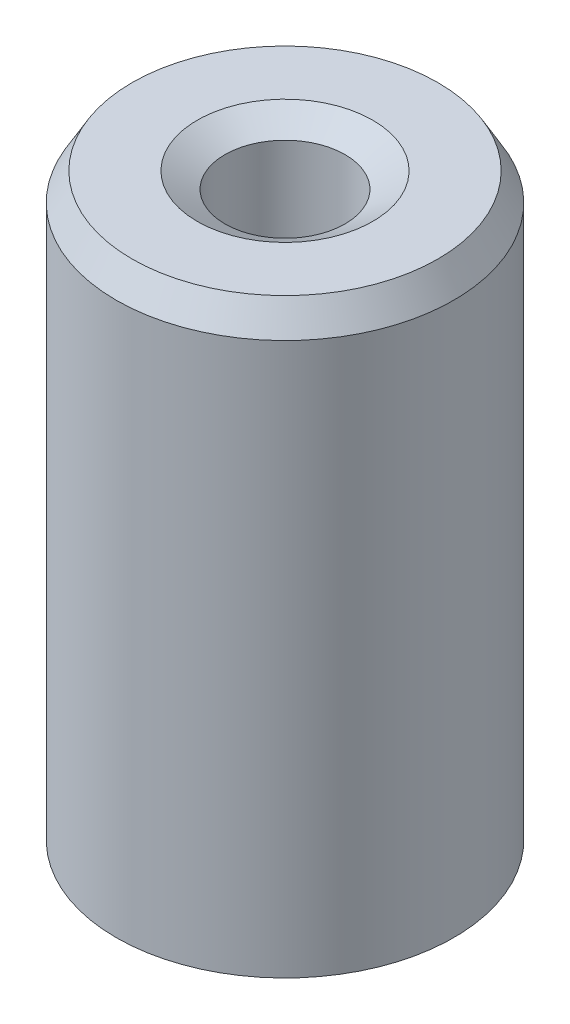
ISO-10303-21;
HEADER;
FILE_DESCRIPTION(('STEP AP214'),'2;1');
FILE_NAME('part.step','',(''),(''),'','','');
FILE_SCHEMA(('AUTOMOTIVE_DESIGN { 1 0 10303 214 1 1 1 1 }'));
ENDSEC;
DATA;
#1=APPLICATION_CONTEXT('core data for automotive mechanical design processes');
#2=APPLICATION_PROTOCOL_DEFINITION('international standard','automotive_design',2000,#1);
#3=PRODUCT_CONTEXT('',#1,'mechanical');
#4=PRODUCT('Part','Part','',(#3));
#5=PRODUCT_RELATED_PRODUCT_CATEGORY('part','',(#4));
#6=PRODUCT_DEFINITION_FORMATION('','',#4);
#7=PRODUCT_DEFINITION_CONTEXT('part definition',#1,'design');
#8=PRODUCT_DEFINITION('design','',#6,#7);
#9=PRODUCT_DEFINITION_SHAPE('','',#8);
#10=(LENGTH_UNIT() NAMED_UNIT(*) SI_UNIT(.MILLI.,.METRE.));
#11=(NAMED_UNIT(*) PLANE_ANGLE_UNIT() SI_UNIT($,.RADIAN.));
#12=(NAMED_UNIT(*) SI_UNIT($,.STERADIAN.) SOLID_ANGLE_UNIT());
#13=UNCERTAINTY_MEASURE_WITH_UNIT(LENGTH_MEASURE(1.E-05),#10,'distance_accuracy_value','');
#14=(GEOMETRIC_REPRESENTATION_CONTEXT(3) GLOBAL_UNCERTAINTY_ASSIGNED_CONTEXT((#13)) GLOBAL_UNIT_ASSIGNED_CONTEXT((#10,
#11,#12)) REPRESENTATION_CONTEXT('',''));
#15=CARTESIAN_POINT('',(0.,0.,0.));
#16=DIRECTION('',(0.,0.,1.));
#17=DIRECTION('',(1.,0.,0.));
#18=AXIS2_PLACEMENT_3D('',#15,#16,#17);
#19=CARTESIAN_POINT('',(0.,26.462460694891,0.));
#20=DIRECTION('',(0.,-1.,0.));
#21=DIRECTION('',(0.,0.,-1.));
#22=AXIS2_PLACEMENT_3D('',#19,#20,#21);
#23=CYLINDRICAL_SURFACE('',#22,7.5);
#24=CARTESIAN_POINT('',(0.,0.70944082375634,0.));
#25=DIRECTION('',(0.,1.,0.));
#26=DIRECTION('',(0.,0.,1.));
#27=AXIS2_PLACEMENT_3D('',#24,#25,#26);
#28=CIRCLE('',#27,7.5);
#29=CARTESIAN_POINT('',(0.,0.709440823756336,-7.5));
#30=VERTEX_POINT('',#29);
#31=EDGE_CURVE('E10',#30,#30,#28,.T.);
#32=CARTESIAN_POINT('',(0.,25.2336731431815,0.));
#33=DIRECTION('',(0.,1.,0.));
#34=DIRECTION('',(0.,0.,1.));
#35=AXIS2_PLACEMENT_3D('',#32,#33,#34);
#36=CIRCLE('',#35,7.5);
#37=CARTESIAN_POINT('',(0.,25.2336731431815,-7.5));
#38=VERTEX_POINT('',#37);
#39=EDGE_CURVE('E50',#38,#38,#36,.F.);
#40=CARTESIAN_POINT('',(0.,0.709440823756336,-7.5));
#41=CARTESIAN_POINT('',(0.,0.964901577083682,-7.5));
#42=CARTESIAN_POINT('',(0.,1.22036233041103,-7.5));
#43=CARTESIAN_POINT('',(0.,1.73128383706572,-7.5));
#44=CARTESIAN_POINT('',(0.,1.98674459039307,-7.5));
#45=CARTESIAN_POINT('',(0.,2.49766609704776,-7.5));
#46=CARTESIAN_POINT('',(0.,2.7531268503751,-7.5));
#47=CARTESIAN_POINT('',(0.,3.26404835702979,-7.5));
#48=CARTESIAN_POINT('',(0.,3.51950911035714,-7.5));
#49=CARTESIAN_POINT('',(0.,4.03043061701183,-7.5));
#50=CARTESIAN_POINT('',(0.,4.28589137033918,-7.5));
#51=CARTESIAN_POINT('',(0.,4.79681287699387,-7.5));
#52=CARTESIAN_POINT('',(0.,5.05227363032122,-7.5));
#53=CARTESIAN_POINT('',(0.,5.56319513697591,-7.5));
#54=CARTESIAN_POINT('',(0.,5.81865589030325,-7.5));
#55=CARTESIAN_POINT('',(0.,6.32957739695794,-7.5));
#56=CARTESIAN_POINT('',(0.,6.58503815028529,-7.5));
#57=CARTESIAN_POINT('',(0.,7.09595965693998,-7.5));
#58=CARTESIAN_POINT('',(0.,7.35142041026733,-7.5));
#59=CARTESIAN_POINT('',(0.,7.86234191692202,-7.5));
#60=CARTESIAN_POINT('',(0.,8.11780267024936,-7.5));
#61=CARTESIAN_POINT('',(0.,8.62872417690406,-7.5));
#62=CARTESIAN_POINT('',(0.,8.8841849302314,-7.5));
#63=CARTESIAN_POINT('',(0.,9.39510643688609,-7.5));
#64=CARTESIAN_POINT('',(0.,9.65056719021344,-7.5));
#65=CARTESIAN_POINT('',(0.,10.1614886968681,-7.5));
#66=CARTESIAN_POINT('',(0.,10.4169494501955,-7.5));
#67=CARTESIAN_POINT('',(0.,10.9278709568502,-7.5));
#68=CARTESIAN_POINT('',(0.,11.1833317101775,-7.5));
#69=CARTESIAN_POINT('',(0.,11.6942532168322,-7.5));
#70=CARTESIAN_POINT('',(0.,11.9497139701595,-7.5));
#71=CARTESIAN_POINT('',(0.,12.4606354768142,-7.5));
#72=CARTESIAN_POINT('',(0.,12.7160962301416,-7.5));
#73=CARTESIAN_POINT('',(0.,13.2270177367963,-7.5));
#74=CARTESIAN_POINT('',(0.,13.4824784901236,-7.5));
#75=CARTESIAN_POINT('',(0.,13.9933999967783,-7.5));
#76=CARTESIAN_POINT('',(0.,14.2488607501057,-7.5));
#77=CARTESIAN_POINT('',(0.,14.7597822567604,-7.5));
#78=CARTESIAN_POINT('',(0.,15.0152430100877,-7.5));
#79=CARTESIAN_POINT('',(0.,15.5261645167424,-7.5));
#80=CARTESIAN_POINT('',(0.,15.7816252700697,-7.5));
#81=CARTESIAN_POINT('',(0.,16.2925467767244,-7.5));
#82=CARTESIAN_POINT('',(0.,16.5480075300518,-7.5));
#83=CARTESIAN_POINT('',(0.,17.0589290367065,-7.5));
#84=CARTESIAN_POINT('',(0.,17.3143897900338,-7.5));
#85=CARTESIAN_POINT('',(0.,17.8253112966885,-7.5));
#86=CARTESIAN_POINT('',(0.,18.0807720500158,-7.5));
#87=CARTESIAN_POINT('',(0.,18.5916935566705,-7.5));
#88=CARTESIAN_POINT('',(0.,18.8471543099979,-7.5));
#89=CARTESIAN_POINT('',(0.,19.3580758166526,-7.5));
#90=CARTESIAN_POINT('',(0.,19.6135365699799,-7.5));
#91=CARTESIAN_POINT('',(0.,20.1244580766346,-7.5));
#92=CARTESIAN_POINT('',(0.,20.379918829962,-7.5));
#93=CARTESIAN_POINT('',(0.,20.8908403366166,-7.5));
#94=CARTESIAN_POINT('',(0.,21.146301089944,-7.5));
#95=CARTESIAN_POINT('',(0.,21.6572225965987,-7.5));
#96=CARTESIAN_POINT('',(0.,21.912683349926,-7.5));
#97=CARTESIAN_POINT('',(0.,22.4236048565807,-7.5));
#98=CARTESIAN_POINT('',(0.,22.6790656099081,-7.5));
#99=CARTESIAN_POINT('',(0.,23.1899871165628,-7.5));
#100=CARTESIAN_POINT('',(0.,23.4454478698901,-7.5));
#101=CARTESIAN_POINT('',(0.,23.9563693765448,-7.5));
#102=CARTESIAN_POINT('',(0.,24.2118301298721,-7.5));
#103=CARTESIAN_POINT('',(0.,24.7227516365268,-7.5));
#104=CARTESIAN_POINT('',(0.,24.9782123898542,-7.5));
#105=CARTESIAN_POINT('',(0.,25.2336731431815,-7.5));
#106=B_SPLINE_CURVE_WITH_KNOTS('',3,(#40,#41,#42,#43,#44,#45,#46,#47,#48,#49,#50,#51,#52,#53,
#54,#55,#56,#57,#58,#59,#60,#61,#62,#63,#64,#65,#66,#67,#68,#69,#70,#71,#72,#73,#74,#75,#76,#77,
#78,#79,#80,#81,#82,#83,#84,#85,#86,#87,#88,#89,#90,#91,#92,#93,#94,#95,#96,#97,#98,#99,#100,
#101,#102,#103,#104,#105),.UNSPECIFIED.,.F.,.F.,(4,2,2,2,2,2,2,2,2,2,2,2,2,2,2,2,2,2,2,2,2,2,2,
2,2,2,2,2,2,2,2,2,4),(0.,0.766382259982039,1.53276451996407,2.29914677994611,3.06552903992815,
3.83191129991019,4.59829355989223,5.36467581987426,6.1310580798563,6.89744033983834,
7.66382259982037,8.43020485980241,9.19658711978445,9.96296937976648,10.7293516397485,
11.4957338997306,12.2621161597126,13.0284984196946,13.7948806796767,14.5612629396587,
15.3276451996407,16.0940274596228,16.8604097196048,17.6267919795869,18.3931742395689,
19.1595564995509,19.925938759533,20.692321019515,21.458703279497,22.2250855394791,
22.9914677994611,23.7578500594432,24.5242323194252),.UNSPECIFIED.);
#107=EDGE_CURVE('BSEAM39',#30,#38,#106,.T.);
#108=ORIENTED_EDGE('',*,*,#31,.T.);
#109=ORIENTED_EDGE('',*,*,#39,.T.);
#110=ORIENTED_EDGE('',*,*,#107,.T.);
#111=ORIENTED_EDGE('',*,*,#107,.F.);
#112=EDGE_LOOP('',(#108,#110,#109,#111));
#113=FACE_BOUND('',#112,.T.);
#114=ADVANCED_FACE('F39',(#113),#23,.T.);
#115=CARTESIAN_POINT('',(0.,26.462460694891,0.));
#116=DIRECTION('',(0.,1.,0.));
#117=DIRECTION('',(0.,0.,1.));
#118=AXIS2_PLACEMENT_3D('',#115,#116,#117);
#119=PLANE('',#118);
#120=CARTESIAN_POINT('',(0.,26.462460694891,0.));
#121=DIRECTION('',(0.,1.,0.));
#122=DIRECTION('',(0.,0.,1.));
#123=AXIS2_PLACEMENT_3D('',#120,#121,#122);
#124=CIRCLE('',#123,3.8981639634891);
#125=CARTESIAN_POINT('',(0.,26.462460694891,3.8981639634891));
#126=VERTEX_POINT('',#125);
#127=EDGE_CURVE('E58',#126,#126,#124,.F.);
#128=ORIENTED_EDGE('',*,*,#127,.T.);
#129=EDGE_LOOP('',(#128));
#130=FACE_BOUND('',#129,.T.);
#131=CARTESIAN_POINT('',(0.,26.462460694891,0.));
#132=DIRECTION('',(0.,1.,0.));
#133=DIRECTION('',(0.,0.,1.));
#134=AXIS2_PLACEMENT_3D('',#131,#132,#133);
#135=CIRCLE('',#134,6.79055917624369);
#136=CARTESIAN_POINT('',(0.,26.462460694891,6.79055917624369));
#137=VERTEX_POINT('',#136);
#138=EDGE_CURVE('E61',#137,#137,#135,.T.);
#139=ORIENTED_EDGE('',*,*,#138,.T.);
#140=EDGE_LOOP('',(#139));
#141=FACE_BOUND('',#140,.T.);
#142=ADVANCED_FACE('F88',(#130,#141),#119,.T.);
#143=CARTESIAN_POINT('',(0.,0.,0.));
#144=DIRECTION('',(0.,1.,0.));
#145=DIRECTION('',(0.,0.,1.));
#146=AXIS2_PLACEMENT_3D('',#143,#144,#145);
#147=PLANE('',#146);
#148=CARTESIAN_POINT('',(0.,0.,0.));
#149=DIRECTION('',(0.,1.,0.));
#150=DIRECTION('',(0.,0.,1.));
#151=AXIS2_PLACEMENT_3D('',#148,#149,#150);
#152=CIRCLE('',#151,3.37881723553594);
#153=CARTESIAN_POINT('',(0.,0.,3.37881723553594));
#154=VERTEX_POINT('',#153);
#155=EDGE_CURVE('E51',#154,#154,#152,.T.);
#156=ORIENTED_EDGE('',*,*,#155,.T.);
#157=EDGE_LOOP('',(#156));
#158=FACE_BOUND('',#157,.T.);
#159=CARTESIAN_POINT('',(0.,0.,0.));
#160=DIRECTION('',(0.,1.,0.));
#161=DIRECTION('',(0.,0.,1.));
#162=AXIS2_PLACEMENT_3D('',#159,#160,#161);
#163=CIRCLE('',#162,6.2712124482905);
#164=CARTESIAN_POINT('',(0.,0.,6.2712124482905));
#165=VERTEX_POINT('',#164);
#166=EDGE_CURVE('E54',#165,#165,#163,.F.);
#167=ORIENTED_EDGE('',*,*,#166,.T.);
#168=EDGE_LOOP('',(#167));
#169=FACE_BOUND('',#168,.T.);
#170=ADVANCED_FACE('F83',(#158,#169),#147,.F.);
#171=CARTESIAN_POINT('',(0.,26.462460694891,0.));
#172=DIRECTION('',(0.,-1.,0.));
#173=DIRECTION('',(0.,0.,-1.));
#174=AXIS2_PLACEMENT_3D('',#171,#172,#173);
#175=CYLINDRICAL_SURFACE('',#174,2.66937641177961);
#176=CARTESIAN_POINT('',(0.,25.7530198711347,0.));
#177=DIRECTION('',(0.,1.,0.));
#178=DIRECTION('',(0.,0.,1.));
#179=AXIS2_PLACEMENT_3D('',#176,#177,#178);
#180=CIRCLE('',#179,2.66937641177961);
#181=CARTESIAN_POINT('',(0.,25.7530198711347,-2.66937641177961));
#182=VERTEX_POINT('',#181);
#183=EDGE_CURVE('E67',#182,#182,#180,.T.);
#184=CARTESIAN_POINT('',(0.,1.22878755170949,0.));
#185=DIRECTION('',(0.,1.,0.));
#186=DIRECTION('',(0.,0.,1.));
#187=AXIS2_PLACEMENT_3D('',#184,#185,#186);
#188=CIRCLE('',#187,2.66937641177961);
#189=CARTESIAN_POINT('',(0.,1.22878755170949,-2.66937641177961));
#190=VERTEX_POINT('',#189);
#191=EDGE_CURVE('E69',#190,#190,#188,.F.);
#192=CARTESIAN_POINT('',(0.,25.7530198711347,-2.66937641177961));
#193=CARTESIAN_POINT('',(0.,25.4975591178073,-2.66937641177961));
#194=CARTESIAN_POINT('',(0.,25.24209836448,-2.66937641177961));
#195=CARTESIAN_POINT('',(0.,24.7311768578253,-2.66937641177961));
#196=CARTESIAN_POINT('',(0.,24.4757161044979,-2.66937641177961));
#197=CARTESIAN_POINT('',(0.,23.9647945978432,-2.66937641177961));
#198=CARTESIAN_POINT('',(0.,23.7093338445159,-2.66937641177961));
#199=CARTESIAN_POINT('',(0.,23.1984123378612,-2.66937641177961));
#200=CARTESIAN_POINT('',(0.,22.9429515845339,-2.66937641177961));
#201=CARTESIAN_POINT('',(0.,22.4320300778792,-2.66937641177961));
#202=CARTESIAN_POINT('',(0.,22.1765693245518,-2.66937641177961));
#203=CARTESIAN_POINT('',(0.,21.6656478178971,-2.66937641177961));
#204=CARTESIAN_POINT('',(0.,21.4101870645698,-2.66937641177961));
#205=CARTESIAN_POINT('',(0.,20.8992655579151,-2.66937641177961));
#206=CARTESIAN_POINT('',(0.,20.6438048045877,-2.66937641177961));
#207=CARTESIAN_POINT('',(0.,20.1328832979331,-2.66937641177961));
#208=CARTESIAN_POINT('',(0.,19.8774225446057,-2.66937641177961));
#209=CARTESIAN_POINT('',(0.,19.366501037951,-2.66937641177961));
#210=CARTESIAN_POINT('',(0.,19.1110402846237,-2.66937641177961));
#211=CARTESIAN_POINT('',(0.,18.600118777969,-2.66937641177961));
#212=CARTESIAN_POINT('',(0.,18.3446580246416,-2.66937641177961));
#213=CARTESIAN_POINT('',(0.,17.8337365179869,-2.66937641177961));
#214=CARTESIAN_POINT('',(0.,17.5782757646596,-2.66937641177961));
#215=CARTESIAN_POINT('',(0.,17.0673542580049,-2.66937641177961));
#216=CARTESIAN_POINT('',(0.,16.8118935046776,-2.66937641177961));
#217=CARTESIAN_POINT('',(0.,16.3009719980229,-2.66937641177961));
#218=CARTESIAN_POINT('',(0.,16.0455112446955,-2.66937641177961));
#219=CARTESIAN_POINT('',(0.,15.5345897380408,-2.66937641177961));
#220=CARTESIAN_POINT('',(0.,15.2791289847135,-2.66937641177961));
#221=CARTESIAN_POINT('',(0.,14.7682074780588,-2.66937641177961));
#222=CARTESIAN_POINT('',(0.,14.5127467247315,-2.66937641177961));
#223=CARTESIAN_POINT('',(0.,14.0018252180768,-2.66937641177961));
#224=CARTESIAN_POINT('',(0.,13.7463644647494,-2.66937641177961));
#225=CARTESIAN_POINT('',(0.,13.2354429580947,-2.66937641177961));
#226=CARTESIAN_POINT('',(0.,12.9799822047674,-2.66937641177961));
#227=CARTESIAN_POINT('',(0.,12.4690606981127,-2.66937641177961));
#228=CARTESIAN_POINT('',(0.,12.2135999447853,-2.66937641177961));
#229=CARTESIAN_POINT('',(0.,11.7026784381307,-2.66937641177961));
#230=CARTESIAN_POINT('',(0.,11.4472176848033,-2.66937641177961));
#231=CARTESIAN_POINT('',(0.,10.9362961781486,-2.66937641177961));
#232=CARTESIAN_POINT('',(0.,10.6808354248213,-2.66937641177961));
#233=CARTESIAN_POINT('',(0.,10.1699139181666,-2.66937641177961));
#234=CARTESIAN_POINT('',(0.,9.91445316483923,-2.66937641177961));
#235=CARTESIAN_POINT('',(0.,9.40353165818454,-2.66937641177961));
#236=CARTESIAN_POINT('',(0.,9.1480709048572,-2.66937641177961));
#237=CARTESIAN_POINT('',(0.,8.63714939820251,-2.66937641177961));
#238=CARTESIAN_POINT('',(0.,8.38168864487516,-2.66937641177961));
#239=CARTESIAN_POINT('',(0.,7.87076713822047,-2.66937641177961));
#240=CARTESIAN_POINT('',(0.,7.61530638489313,-2.66937641177961));
#241=CARTESIAN_POINT('',(0.,7.10438487823843,-2.66937641177961));
#242=CARTESIAN_POINT('',(0.,6.84892412491109,-2.66937641177961));
#243=CARTESIAN_POINT('',(0.,6.3380026182564,-2.66937641177961));
#244=CARTESIAN_POINT('',(0.,6.08254186492905,-2.66937641177961));
#245=CARTESIAN_POINT('',(0.,5.57162035827436,-2.66937641177961));
#246=CARTESIAN_POINT('',(0.,5.31615960494702,-2.66937641177961));
#247=CARTESIAN_POINT('',(0.,4.80523809829232,-2.66937641177961));
#248=CARTESIAN_POINT('',(0.,4.54977734496498,-2.66937641177961));
#249=CARTESIAN_POINT('',(0.,4.03885583831029,-2.66937641177961));
#250=CARTESIAN_POINT('',(0.,3.78339508498294,-2.66937641177961));
#251=CARTESIAN_POINT('',(0.,3.27247357832825,-2.66937641177961));
#252=CARTESIAN_POINT('',(0.,3.01701282500091,-2.66937641177961));
#253=CARTESIAN_POINT('',(0.,2.50609131834622,-2.66937641177961));
#254=CARTESIAN_POINT('',(0.,2.25063056501887,-2.66937641177961));
#255=CARTESIAN_POINT('',(0.,1.73970905836418,-2.66937641177961));
#256=CARTESIAN_POINT('',(0.,1.48424830503683,-2.66937641177961));
#257=CARTESIAN_POINT('',(0.,1.22878755170949,-2.66937641177961));
#258=B_SPLINE_CURVE_WITH_KNOTS('',3,(#192,#193,#194,#195,#196,#197,#198,#199,#200,#201,#202,
#203,#204,#205,#206,#207,#208,#209,#210,#211,#212,#213,#214,#215,#216,#217,#218,#219,#220,#221,
#222,#223,#224,#225,#226,#227,#228,#229,#230,#231,#232,#233,#234,#235,#236,#237,#238,#239,#240,
#241,#242,#243,#244,#245,#246,#247,#248,#249,#250,#251,#252,#253,#254,#255,#256,#257),
.UNSPECIFIED.,.F.,.F.,(4,2,2,2,2,2,2,2,2,2,2,2,2,2,2,2,2,2,2,2,2,2,2,2,2,2,2,2,2,2,2,2,4),(0.,
0.766382259982035,1.53276451996407,2.29914677994611,3.06552903992814,3.83191129991018,
4.59829355989222,5.36467581987425,6.13105807985629,6.89744033983833,7.66382259982036,
8.4302048598024,9.19658711978444,9.96296937976647,10.7293516397485,11.4957338997305,
12.2621161597126,13.0284984196946,13.7948806796767,14.5612629396587,15.3276451996407,
16.0940274596228,16.8604097196048,17.6267919795868,18.3931742395689,19.1595564995509,
19.9259387595329,20.692321019515,21.458703279497,22.225085539479,22.9914677994611,
23.7578500594431,24.5242323194252),.UNSPECIFIED.);
#259=EDGE_CURVE('BSEAM71',#182,#190,#258,.T.);
#260=ORIENTED_EDGE('',*,*,#183,.T.);
#261=ORIENTED_EDGE('',*,*,#191,.T.);
#262=ORIENTED_EDGE('',*,*,#259,.T.);
#263=ORIENTED_EDGE('',*,*,#259,.F.);
#264=EDGE_LOOP('',(#260,#262,#261,#263));
#265=FACE_BOUND('',#264,.T.);
#266=ADVANCED_FACE('F71',(#265),#175,.F.);
#267=CARTESIAN_POINT('',(0.,25.7530198711347,0.));
#268=DIRECTION('',(0.,1.,0.));
#269=DIRECTION('',(0.,0.,1.));
#270=AXIS2_PLACEMENT_3D('',#267,#268,#269);
#271=CONICAL_SURFACE('',#270,2.66937641177961,1.0471975511966);
#272=ORIENTED_EDGE('',*,*,#127,.F.);
#273=EDGE_LOOP('',(#272));
#274=FACE_BOUND('',#273,.T.);
#275=ORIENTED_EDGE('',*,*,#183,.F.);
#276=EDGE_LOOP('',(#275));
#277=FACE_BOUND('',#276,.T.);
#278=ADVANCED_FACE('F77',(#274,#277),#271,.F.);
#279=CARTESIAN_POINT('',(0.,0.,0.));
#280=DIRECTION('',(0.,-1.,0.));
#281=DIRECTION('',(0.,0.,-1.));
#282=AXIS2_PLACEMENT_3D('',#279,#280,#281);
#283=CONICAL_SURFACE('',#282,3.37881723553594,0.523598775598293);
#284=ORIENTED_EDGE('',*,*,#191,.F.);
#285=EDGE_LOOP('',(#284));
#286=FACE_BOUND('',#285,.T.);
#287=ORIENTED_EDGE('',*,*,#155,.F.);
#288=EDGE_LOOP('',(#287));
#289=FACE_BOUND('',#288,.T.);
#290=ADVANCED_FACE('F73',(#286,#289),#283,.F.);
#291=CARTESIAN_POINT('',(0.,0.70944082375634,0.));
#292=DIRECTION('',(0.,1.,0.));
#293=DIRECTION('',(0.,0.,1.));
#294=AXIS2_PLACEMENT_3D('',#291,#292,#293);
#295=CONICAL_SURFACE('',#294,7.5,1.0471975511966);
#296=ORIENTED_EDGE('',*,*,#166,.F.);
#297=EDGE_LOOP('',(#296));
#298=FACE_BOUND('',#297,.T.);
#299=ORIENTED_EDGE('',*,*,#31,.F.);
#300=EDGE_LOOP('',(#299));
#301=FACE_BOUND('',#300,.T.);
#302=ADVANCED_FACE('F76',(#298,#301),#295,.T.);
#303=CARTESIAN_POINT('',(0.,26.462460694891,0.));
#304=DIRECTION('',(0.,-1.,0.));
#305=DIRECTION('',(0.,0.,-1.));
#306=AXIS2_PLACEMENT_3D('',#303,#304,#305);
#307=CONICAL_SURFACE('',#306,6.79055917624369,0.523598775598296);
#308=ORIENTED_EDGE('',*,*,#39,.F.);
#309=EDGE_LOOP('',(#308));
#310=FACE_BOUND('',#309,.T.);
#311=ORIENTED_EDGE('',*,*,#138,.F.);
#312=EDGE_LOOP('',(#311));
#313=FACE_BOUND('',#312,.T.);
#314=ADVANCED_FACE('F45',(#310,#313),#307,.T.);
#315=CLOSED_SHELL('',(#114,#142,#170,#266,#278,#290,#302,#314));
#316=MANIFOLD_SOLID_BREP('B2',#315);
#317=ADVANCED_BREP_SHAPE_REPRESENTATION('',(#18,#316),#14);
#318=SHAPE_DEFINITION_REPRESENTATION(#9,#317);
ENDSEC;
END-ISO-10303-21;
